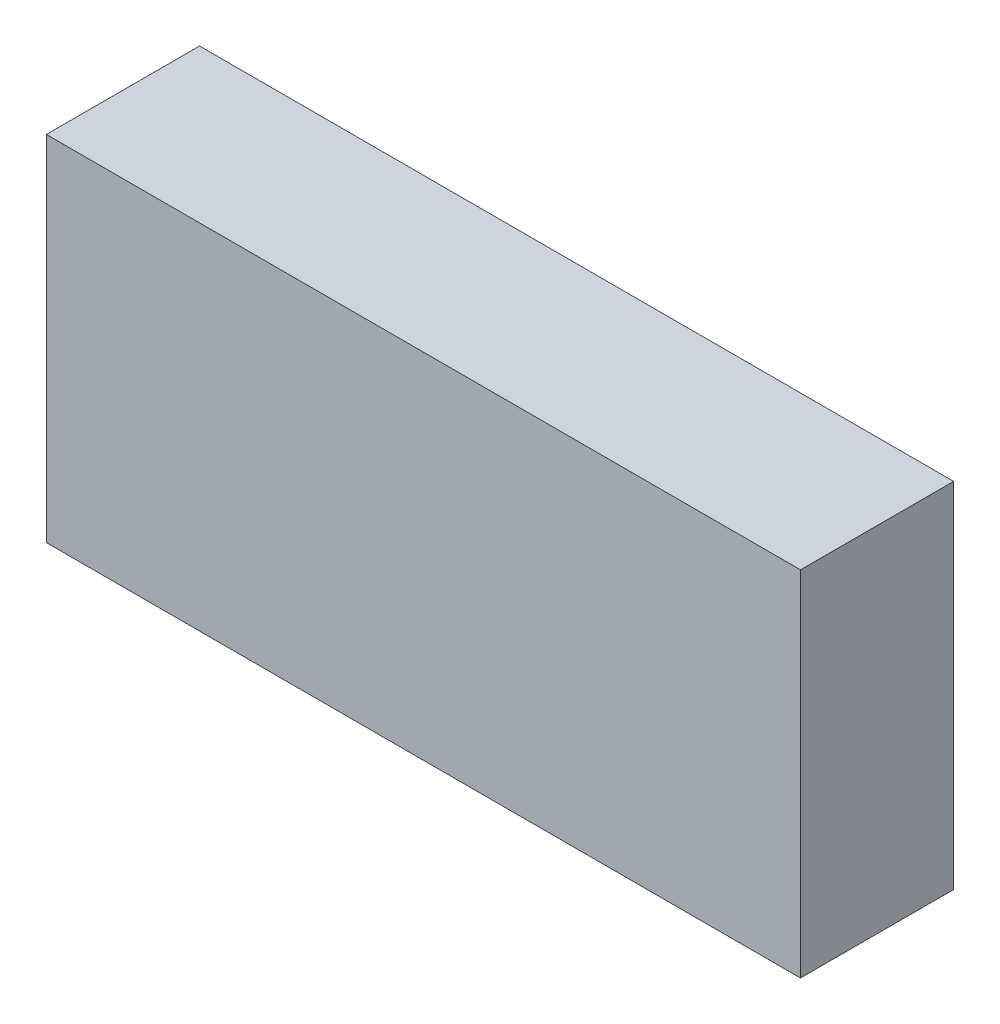
ISO-10303-21;
HEADER;
FILE_DESCRIPTION(('STEP AP214'),'2;1');
FILE_NAME('part.step','',(''),(''),'','','');
FILE_SCHEMA(('AUTOMOTIVE_DESIGN { 1 0 10303 214 1 1 1 1 }'));
ENDSEC;
DATA;
#1=APPLICATION_CONTEXT('core data for automotive mechanical design processes');
#2=APPLICATION_PROTOCOL_DEFINITION('international standard','automotive_design',2000,#1);
#3=PRODUCT_CONTEXT('',#1,'mechanical');
#4=PRODUCT('Part','Part','',(#3));
#5=PRODUCT_RELATED_PRODUCT_CATEGORY('part','',(#4));
#6=PRODUCT_DEFINITION_FORMATION('','',#4);
#7=PRODUCT_DEFINITION_CONTEXT('part definition',#1,'design');
#8=PRODUCT_DEFINITION('design','',#6,#7);
#9=PRODUCT_DEFINITION_SHAPE('','',#8);
#10=(LENGTH_UNIT() NAMED_UNIT(*) SI_UNIT(.MILLI.,.METRE.));
#11=(NAMED_UNIT(*) PLANE_ANGLE_UNIT() SI_UNIT($,.RADIAN.));
#12=(NAMED_UNIT(*) SI_UNIT($,.STERADIAN.) SOLID_ANGLE_UNIT());
#13=UNCERTAINTY_MEASURE_WITH_UNIT(LENGTH_MEASURE(1.E-05),#10,'distance_accuracy_value','');
#14=(GEOMETRIC_REPRESENTATION_CONTEXT(3) GLOBAL_UNCERTAINTY_ASSIGNED_CONTEXT((#13)) GLOBAL_UNIT_ASSIGNED_CONTEXT((#10,
#11,#12)) REPRESENTATION_CONTEXT('',''));
#15=CARTESIAN_POINT('',(0.,0.,0.));
#16=DIRECTION('',(0.,0.,1.));
#17=DIRECTION('',(1.,0.,0.));
#18=AXIS2_PLACEMENT_3D('',#15,#16,#17);
#19=CARTESIAN_POINT('',(-1.59999934,0.75000104,0.65000124));
#20=DIRECTION('',(0.,0.,1.));
#21=DIRECTION('',(1.,0.,0.));
#22=AXIS2_PLACEMENT_3D('',#19,#20,#21);
#23=PLANE('',#22);
#24=DIRECTION('',(0.,1.,0.));
#25=VECTOR('',#24,1.);
#26=CARTESIAN_POINT('',(1.59999934,0.75000104,0.65000124));
#27=LINE('',#26,#25);
#28=CARTESIAN_POINT('',(1.59999934,0.75000104,0.65000124));
#29=VERTEX_POINT('',#28);
#30=CARTESIAN_POINT('',(1.59999934,-0.75000104,0.65000124));
#31=VERTEX_POINT('',#30);
#32=EDGE_CURVE('E52',#29,#31,#27,.F.);
#33=ORIENTED_EDGE('',*,*,#32,.F.);
#34=DIRECTION('',(1.,0.,0.));
#35=VECTOR('',#34,1.);
#36=CARTESIAN_POINT('',(-1.59999934,0.75000104,0.65000124));
#37=LINE('',#36,#35);
#38=CARTESIAN_POINT('',(-1.59999934,0.75000104,0.65000124));
#39=VERTEX_POINT('',#38);
#40=EDGE_CURVE('E67',#39,#29,#37,.T.);
#41=ORIENTED_EDGE('',*,*,#40,.F.);
#42=DIRECTION('',(0.,1.,0.));
#43=VECTOR('',#42,1.);
#44=CARTESIAN_POINT('',(-1.59999934,-0.75000104,0.65000124));
#45=LINE('',#44,#43);
#46=CARTESIAN_POINT('',(-1.59999934,-0.75000104,0.65000124));
#47=VERTEX_POINT('',#46);
#48=EDGE_CURVE('E19',#47,#39,#45,.T.);
#49=ORIENTED_EDGE('',*,*,#48,.F.);
#50=DIRECTION('',(1.,0.,0.));
#51=VECTOR('',#50,1.);
#52=CARTESIAN_POINT('',(1.59999934,-0.75000104,0.65000124));
#53=LINE('',#52,#51);
#54=EDGE_CURVE('E57',#31,#47,#53,.F.);
#55=ORIENTED_EDGE('',*,*,#54,.F.);
#56=EDGE_LOOP('',(#33,#41,#49,#55));
#57=FACE_BOUND('',#56,.T.);
#58=ADVANCED_FACE('F16',(#57),#23,.T.);
#59=CARTESIAN_POINT('',(-1.59999934,-0.75000104,0.));
#60=DIRECTION('',(-1.,0.,0.));
#61=DIRECTION('',(0.,0.,1.));
#62=AXIS2_PLACEMENT_3D('',#59,#60,#61);
#63=PLANE('',#62);
#64=DIRECTION('',(0.,0.,1.));
#65=VECTOR('',#64,1.);
#66=CARTESIAN_POINT('',(-1.59999934,0.75000104,0.));
#67=LINE('',#66,#65);
#68=CARTESIAN_POINT('',(-1.59999934,0.75000104,0.));
#69=VERTEX_POINT('',#68);
#70=EDGE_CURVE('E78',#69,#39,#67,.T.);
#71=ORIENTED_EDGE('',*,*,#70,.F.);
#72=DIRECTION('',(0.,1.,0.));
#73=VECTOR('',#72,1.);
#74=CARTESIAN_POINT('',(-1.59999934,0.75000104,0.));
#75=LINE('',#74,#73);
#76=CARTESIAN_POINT('',(-1.59999934,-0.75000104,0.));
#77=VERTEX_POINT('',#76);
#78=EDGE_CURVE('E73',#69,#77,#75,.F.);
#79=ORIENTED_EDGE('',*,*,#78,.T.);
#80=DIRECTION('',(0.,0.,-1.));
#81=VECTOR('',#80,1.);
#82=CARTESIAN_POINT('',(-1.59999934,-0.75000104,0.));
#83=LINE('',#82,#81);
#84=EDGE_CURVE('E62',#47,#77,#83,.T.);
#85=ORIENTED_EDGE('',*,*,#84,.F.);
#86=ORIENTED_EDGE('',*,*,#48,.T.);
#87=EDGE_LOOP('',(#71,#79,#85,#86));
#88=FACE_BOUND('',#87,.T.);
#89=ADVANCED_FACE('F72',(#88),#63,.T.);
#90=CARTESIAN_POINT('',(1.59999934,-0.75000104,0.));
#91=DIRECTION('',(0.,-1.,0.));
#92=DIRECTION('',(0.,0.,-1.));
#93=AXIS2_PLACEMENT_3D('',#90,#91,#92);
#94=PLANE('',#93);
#95=ORIENTED_EDGE('',*,*,#84,.T.);
#96=DIRECTION('',(1.,0.,0.));
#97=VECTOR('',#96,1.);
#98=CARTESIAN_POINT('',(-1.59999934,-0.75000104,0.));
#99=LINE('',#98,#97);
#100=CARTESIAN_POINT('',(1.59999934,-0.75000104,0.));
#101=VERTEX_POINT('',#100);
#102=EDGE_CURVE('E83',#77,#101,#99,.T.);
#103=ORIENTED_EDGE('',*,*,#102,.T.);
#104=DIRECTION('',(0.,0.,-1.));
#105=VECTOR('',#104,1.);
#106=CARTESIAN_POINT('',(1.59999934,-0.75000104,0.));
#107=LINE('',#106,#105);
#108=EDGE_CURVE('E64',#31,#101,#107,.T.);
#109=ORIENTED_EDGE('',*,*,#108,.F.);
#110=ORIENTED_EDGE('',*,*,#54,.T.);
#111=EDGE_LOOP('',(#95,#103,#109,#110));
#112=FACE_BOUND('',#111,.T.);
#113=ADVANCED_FACE('F59',(#112),#94,.T.);
#114=CARTESIAN_POINT('',(1.59999934,0.75000104,0.));
#115=DIRECTION('',(1.,0.,0.));
#116=DIRECTION('',(0.,0.,-1.));
#117=AXIS2_PLACEMENT_3D('',#114,#115,#116);
#118=PLANE('',#117);
#119=ORIENTED_EDGE('',*,*,#108,.T.);
#120=DIRECTION('',(0.,1.,0.));
#121=VECTOR('',#120,1.);
#122=CARTESIAN_POINT('',(1.59999934,0.75000104,0.));
#123=LINE('',#122,#121);
#124=CARTESIAN_POINT('',(1.59999934,0.75000104,0.));
#125=VERTEX_POINT('',#124);
#126=EDGE_CURVE('E25',#101,#125,#123,.T.);
#127=ORIENTED_EDGE('',*,*,#126,.T.);
#128=DIRECTION('',(0.,0.,1.));
#129=VECTOR('',#128,1.);
#130=CARTESIAN_POINT('',(1.59999934,0.75000104,0.));
#131=LINE('',#130,#129);
#132=EDGE_CURVE('E33',#29,#125,#131,.F.);
#133=ORIENTED_EDGE('',*,*,#132,.F.);
#134=ORIENTED_EDGE('',*,*,#32,.T.);
#135=EDGE_LOOP('',(#119,#127,#133,#134));
#136=FACE_BOUND('',#135,.T.);
#137=ADVANCED_FACE('F87',(#136),#118,.T.);
#138=CARTESIAN_POINT('',(-1.59999934,0.75000104,0.));
#139=DIRECTION('',(0.,1.,0.));
#140=DIRECTION('',(0.,0.,1.));
#141=AXIS2_PLACEMENT_3D('',#138,#139,#140);
#142=PLANE('',#141);
#143=ORIENTED_EDGE('',*,*,#132,.T.);
#144=DIRECTION('',(1.,0.,0.));
#145=VECTOR('',#144,1.);
#146=CARTESIAN_POINT('',(-1.59999934,0.75000104,0.));
#147=LINE('',#146,#145);
#148=EDGE_CURVE('E11',#125,#69,#147,.F.);
#149=ORIENTED_EDGE('',*,*,#148,.T.);
#150=ORIENTED_EDGE('',*,*,#70,.T.);
#151=ORIENTED_EDGE('',*,*,#40,.T.);
#152=EDGE_LOOP('',(#143,#149,#150,#151));
#153=FACE_BOUND('',#152,.T.);
#154=ADVANCED_FACE('F90',(#153),#142,.T.);
#155=CARTESIAN_POINT('',(-1.59999934,0.75000104,0.));
#156=DIRECTION('',(0.,0.,1.));
#157=DIRECTION('',(1.,0.,0.));
#158=AXIS2_PLACEMENT_3D('',#155,#156,#157);
#159=PLANE('',#158);
#160=ORIENTED_EDGE('',*,*,#126,.F.);
#161=ORIENTED_EDGE('',*,*,#102,.F.);
#162=ORIENTED_EDGE('',*,*,#78,.F.);
#163=ORIENTED_EDGE('',*,*,#148,.F.);
#164=EDGE_LOOP('',(#160,#161,#162,#163));
#165=FACE_BOUND('',#164,.T.);
#166=ADVANCED_FACE('F89',(#165),#159,.F.);
#167=CLOSED_SHELL('',(#58,#89,#113,#137,#154,#166));
#168=MANIFOLD_SOLID_BREP('B1',#167);
#169=ADVANCED_BREP_SHAPE_REPRESENTATION('',(#18,#168),#14);
#170=SHAPE_DEFINITION_REPRESENTATION(#9,#169);
ENDSEC;
END-ISO-10303-21;
